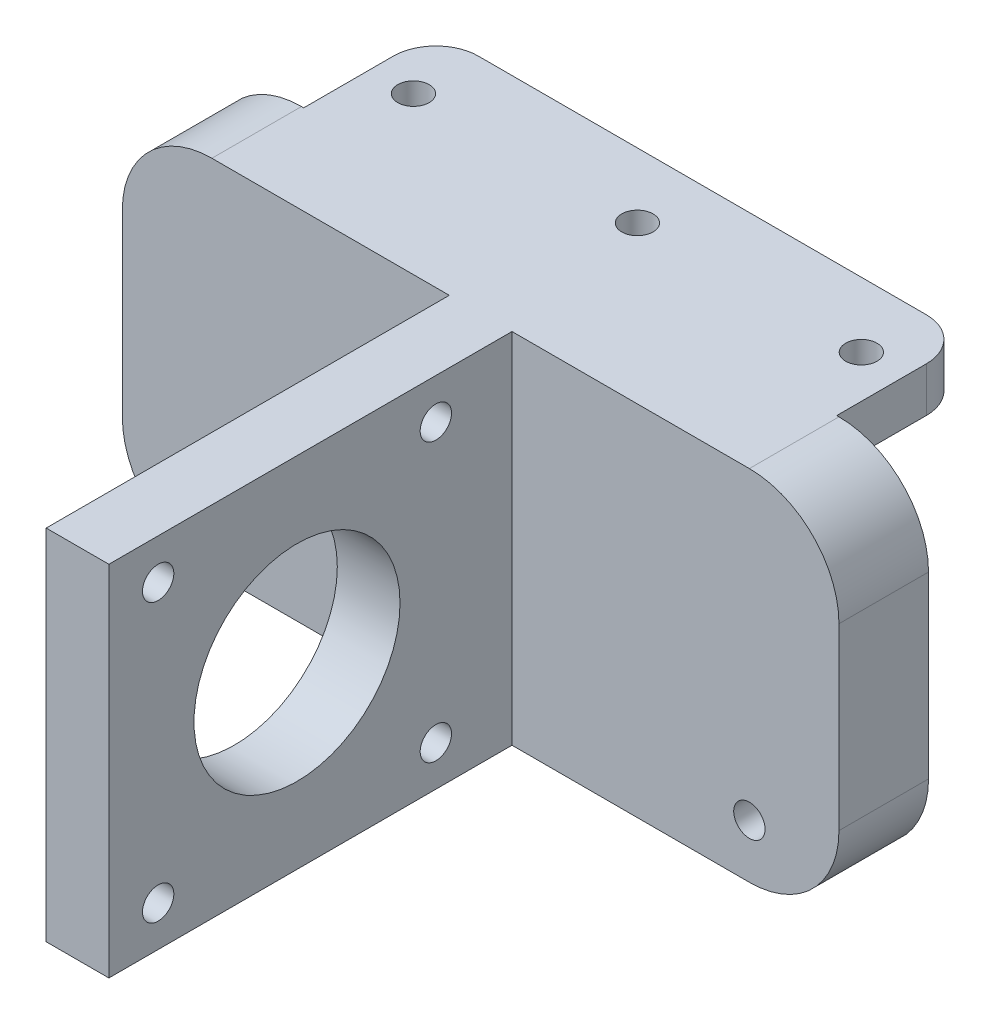
ISO-10303-21;
HEADER;
FILE_DESCRIPTION(('STEP AP214'),'2;1');
FILE_NAME('part.step','',(''),(''),'','','');
FILE_SCHEMA(('AUTOMOTIVE_DESIGN { 1 0 10303 214 1 1 1 1 }'));
ENDSEC;
DATA;
#1=APPLICATION_CONTEXT('core data for automotive mechanical design processes');
#2=APPLICATION_PROTOCOL_DEFINITION('international standard','automotive_design',2000,#1);
#3=PRODUCT_CONTEXT('',#1,'mechanical');
#4=PRODUCT('Part','Part','',(#3));
#5=PRODUCT_RELATED_PRODUCT_CATEGORY('part','',(#4));
#6=PRODUCT_DEFINITION_FORMATION('','',#4);
#7=PRODUCT_DEFINITION_CONTEXT('part definition',#1,'design');
#8=PRODUCT_DEFINITION('design','',#6,#7);
#9=PRODUCT_DEFINITION_SHAPE('','',#8);
#10=(LENGTH_UNIT() NAMED_UNIT(*) SI_UNIT(.MILLI.,.METRE.));
#11=(NAMED_UNIT(*) PLANE_ANGLE_UNIT() SI_UNIT($,.RADIAN.));
#12=(NAMED_UNIT(*) SI_UNIT($,.STERADIAN.) SOLID_ANGLE_UNIT());
#13=UNCERTAINTY_MEASURE_WITH_UNIT(LENGTH_MEASURE(1.E-05),#10,'distance_accuracy_value','');
#14=(GEOMETRIC_REPRESENTATION_CONTEXT(3) GLOBAL_UNCERTAINTY_ASSIGNED_CONTEXT((#13)) GLOBAL_UNIT_ASSIGNED_CONTEXT((#10,
#11,#12)) REPRESENTATION_CONTEXT('',''));
#15=CARTESIAN_POINT('',(0.,0.,0.));
#16=DIRECTION('',(0.,0.,1.));
#17=DIRECTION('',(1.,0.,0.));
#18=AXIS2_PLACEMENT_3D('',#15,#16,#17);
#19=CARTESIAN_POINT('',(0.,30.,10.));
#20=DIRECTION('',(0.,0.,1.));
#21=DIRECTION('',(1.,0.,0.));
#22=AXIS2_PLACEMENT_3D('',#19,#20,#21);
#23=PLANE('',#22);
#24=DIRECTION('',(0.,1.,0.));
#25=VECTOR('',#24,1.);
#26=CARTESIAN_POINT('',(33.5,40.,10.));
#27=LINE('',#26,#25);
#28=CARTESIAN_POINT('',(33.5,0.,10.));
#29=VERTEX_POINT('',#28);
#30=CARTESIAN_POINT('',(33.5,40.,10.));
#31=VERTEX_POINT('',#30);
#32=EDGE_CURVE('E50',#29,#31,#27,.T.);
#33=ORIENTED_EDGE('',*,*,#32,.F.);
#34=DIRECTION('',(1.,0.,0.));
#35=VECTOR('',#34,1.);
#36=CARTESIAN_POINT('',(0.,0.,10.));
#37=LINE('',#36,#35);
#38=CARTESIAN_POINT('',(60.,0.,10.));
#39=VERTEX_POINT('',#38);
#40=EDGE_CURVE('E245',#29,#39,#37,.T.);
#41=ORIENTED_EDGE('',*,*,#40,.T.);
#42=CARTESIAN_POINT('',(60.,10.,10.));
#43=DIRECTION('',(0.,0.,1.));
#44=DIRECTION('',(1.,0.,0.));
#45=AXIS2_PLACEMENT_3D('',#42,#43,#44);
#46=CIRCLE('',#45,10.);
#47=CARTESIAN_POINT('',(70.,10.,10.));
#48=VERTEX_POINT('',#47);
#49=EDGE_CURVE('E248',#39,#48,#46,.T.);
#50=ORIENTED_EDGE('',*,*,#49,.T.);
#51=DIRECTION('',(0.,1.,0.));
#52=VECTOR('',#51,1.);
#53=CARTESIAN_POINT('',(70.,10.,10.));
#54=LINE('',#53,#52);
#55=CARTESIAN_POINT('',(70.,30.,10.));
#56=VERTEX_POINT('',#55);
#57=EDGE_CURVE('E250',#48,#56,#54,.T.);
#58=ORIENTED_EDGE('',*,*,#57,.T.);
#59=CARTESIAN_POINT('',(60.,30.,10.));
#60=DIRECTION('',(0.,0.,1.));
#61=DIRECTION('',(1.,0.,0.));
#62=AXIS2_PLACEMENT_3D('',#59,#60,#61);
#63=CIRCLE('',#62,10.);
#64=CARTESIAN_POINT('',(60.,40.,10.));
#65=VERTEX_POINT('',#64);
#66=EDGE_CURVE('E252',#56,#65,#63,.T.);
#67=ORIENTED_EDGE('',*,*,#66,.T.);
#68=DIRECTION('',(-1.,0.,0.));
#69=VECTOR('',#68,1.);
#70=CARTESIAN_POINT('',(0.,40.,10.));
#71=LINE('',#70,#69);
#72=EDGE_CURVE('E234',#65,#31,#71,.T.);
#73=ORIENTED_EDGE('',*,*,#72,.T.);
#74=EDGE_LOOP('',(#33,#41,#50,#58,#67,#73));
#75=FACE_BOUND('',#74,.T.);
#76=CARTESIAN_POINT('',(60.,6.,10.));
#77=DIRECTION('',(0.,0.,1.));
#78=DIRECTION('',(1.,0.,0.));
#79=AXIS2_PLACEMENT_3D('',#76,#77,#78);
#80=CIRCLE('',#79,1.75);
#81=CARTESIAN_POINT('',(61.75,6.,10.));
#82=VERTEX_POINT('',#81);
#83=EDGE_CURVE('E226',#82,#82,#80,.T.);
#84=ORIENTED_EDGE('',*,*,#83,.F.);
#85=EDGE_LOOP('',(#84));
#86=FACE_BOUND('',#85,.T.);
#87=ADVANCED_FACE('F33',(#75,#86),#23,.T.);
#88=CARTESIAN_POINT('',(0.,30.,10.));
#89=DIRECTION('',(0.,0.,-1.));
#90=DIRECTION('',(-1.,0.,0.));
#91=AXIS2_PLACEMENT_3D('',#88,#89,#90);
#92=CYLINDRICAL_SURFACE('',#91,10.);
#93=CARTESIAN_POINT('',(0.,30.,0.));
#94=DIRECTION('',(0.,0.,1.));
#95=DIRECTION('',(1.,0.,0.));
#96=AXIS2_PLACEMENT_3D('',#93,#94,#95);
#97=CIRCLE('',#96,10.);
#98=CARTESIAN_POINT('',(0.,40.,0.));
#99=VERTEX_POINT('',#98);
#100=CARTESIAN_POINT('',(-10.,30.,0.));
#101=VERTEX_POINT('',#100);
#102=EDGE_CURVE('E257',#99,#101,#97,.T.);
#103=ORIENTED_EDGE('',*,*,#102,.T.);
#104=DIRECTION('',(0.,0.,-1.));
#105=VECTOR('',#104,1.);
#106=CARTESIAN_POINT('',(-10.,30.,10.));
#107=LINE('',#106,#105);
#108=CARTESIAN_POINT('',(-10.,30.,10.));
#109=VERTEX_POINT('',#108);
#110=EDGE_CURVE('E288',#109,#101,#107,.T.);
#111=ORIENTED_EDGE('',*,*,#110,.F.);
#112=CARTESIAN_POINT('',(0.,30.,10.));
#113=DIRECTION('',(0.,0.,1.));
#114=DIRECTION('',(1.,0.,0.));
#115=AXIS2_PLACEMENT_3D('',#112,#113,#114);
#116=CIRCLE('',#115,10.);
#117=CARTESIAN_POINT('',(0.,40.,10.));
#118=VERTEX_POINT('',#117);
#119=EDGE_CURVE('E238',#118,#109,#116,.T.);
#120=ORIENTED_EDGE('',*,*,#119,.F.);
#121=DIRECTION('',(0.,0.,-1.));
#122=VECTOR('',#121,1.);
#123=CARTESIAN_POINT('',(0.,40.,10.));
#124=LINE('',#123,#122);
#125=EDGE_CURVE('E291',#118,#99,#124,.T.);
#126=ORIENTED_EDGE('',*,*,#125,.T.);
#127=EDGE_LOOP('',(#103,#111,#120,#126));
#128=FACE_BOUND('',#127,.T.);
#129=ADVANCED_FACE('F35',(#128),#92,.T.);
#130=CARTESIAN_POINT('',(-10.,30.,10.));
#131=DIRECTION('',(1.,0.,0.));
#132=DIRECTION('',(0.,0.,-1.));
#133=AXIS2_PLACEMENT_3D('',#130,#131,#132);
#134=PLANE('',#133);
#135=DIRECTION('',(0.,-1.,0.));
#136=VECTOR('',#135,1.);
#137=CARTESIAN_POINT('',(-10.,30.,0.));
#138=LINE('',#137,#136);
#139=CARTESIAN_POINT('',(-10.,10.,0.));
#140=VERTEX_POINT('',#139);
#141=EDGE_CURVE('E259',#101,#140,#138,.T.);
#142=ORIENTED_EDGE('',*,*,#141,.T.);
#143=DIRECTION('',(0.,0.,-1.));
#144=VECTOR('',#143,1.);
#145=CARTESIAN_POINT('',(-10.,10.,10.));
#146=LINE('',#145,#144);
#147=CARTESIAN_POINT('',(-10.,10.,10.));
#148=VERTEX_POINT('',#147);
#149=EDGE_CURVE('E285',#148,#140,#146,.T.);
#150=ORIENTED_EDGE('',*,*,#149,.F.);
#151=DIRECTION('',(0.,-1.,0.));
#152=VECTOR('',#151,1.);
#153=CARTESIAN_POINT('',(-10.,30.,10.));
#154=LINE('',#153,#152);
#155=EDGE_CURVE('E240',#109,#148,#154,.T.);
#156=ORIENTED_EDGE('',*,*,#155,.F.);
#157=ORIENTED_EDGE('',*,*,#110,.T.);
#158=EDGE_LOOP('',(#142,#150,#156,#157));
#159=FACE_BOUND('',#158,.T.);
#160=ADVANCED_FACE('F372',(#159),#134,.F.);
#161=CARTESIAN_POINT('',(0.,10.,10.));
#162=DIRECTION('',(0.,0.,-1.));
#163=DIRECTION('',(-1.,0.,0.));
#164=AXIS2_PLACEMENT_3D('',#161,#162,#163);
#165=CYLINDRICAL_SURFACE('',#164,10.);
#166=CARTESIAN_POINT('',(0.,10.,0.));
#167=DIRECTION('',(0.,0.,1.));
#168=DIRECTION('',(1.,0.,0.));
#169=AXIS2_PLACEMENT_3D('',#166,#167,#168);
#170=CIRCLE('',#169,10.);
#171=CARTESIAN_POINT('',(0.,0.,0.));
#172=VERTEX_POINT('',#171);
#173=EDGE_CURVE('E261',#140,#172,#170,.T.);
#174=ORIENTED_EDGE('',*,*,#173,.T.);
#175=DIRECTION('',(0.,0.,-1.));
#176=VECTOR('',#175,1.);
#177=CARTESIAN_POINT('',(0.,0.,10.));
#178=LINE('',#177,#176);
#179=CARTESIAN_POINT('',(0.,0.,10.));
#180=VERTEX_POINT('',#179);
#181=EDGE_CURVE('E282',#180,#172,#178,.T.);
#182=ORIENTED_EDGE('',*,*,#181,.F.);
#183=CARTESIAN_POINT('',(0.,10.,10.));
#184=DIRECTION('',(0.,0.,1.));
#185=DIRECTION('',(1.,0.,0.));
#186=AXIS2_PLACEMENT_3D('',#183,#184,#185);
#187=CIRCLE('',#186,10.);
#188=EDGE_CURVE('E243',#148,#180,#187,.T.);
#189=ORIENTED_EDGE('',*,*,#188,.F.);
#190=ORIENTED_EDGE('',*,*,#149,.T.);
#191=EDGE_LOOP('',(#174,#182,#189,#190));
#192=FACE_BOUND('',#191,.T.);
#193=ADVANCED_FACE('F483',(#192),#165,.T.);
#194=CARTESIAN_POINT('',(0.,0.,10.));
#195=DIRECTION('',(0.,1.,0.));
#196=DIRECTION('',(0.,0.,1.));
#197=AXIS2_PLACEMENT_3D('',#194,#195,#196);
#198=PLANE('',#197);
#199=DIRECTION('',(1.,0.,0.));
#200=VECTOR('',#199,1.);
#201=CARTESIAN_POINT('',(0.,0.,0.));
#202=LINE('',#201,#200);
#203=CARTESIAN_POINT('',(60.,0.,0.));
#204=VERTEX_POINT('',#203);
#205=EDGE_CURVE('E263',#172,#204,#202,.T.);
#206=ORIENTED_EDGE('',*,*,#205,.T.);
#207=DIRECTION('',(0.,0.,-1.));
#208=VECTOR('',#207,1.);
#209=CARTESIAN_POINT('',(60.,0.,10.));
#210=LINE('',#209,#208);
#211=EDGE_CURVE('E279',#39,#204,#210,.T.);
#212=ORIENTED_EDGE('',*,*,#211,.F.);
#213=ORIENTED_EDGE('',*,*,#40,.F.);
#214=DIRECTION('',(0.,0.,-1.));
#215=VECTOR('',#214,1.);
#216=CARTESIAN_POINT('',(33.5,0.,55.));
#217=LINE('',#216,#215);
#218=CARTESIAN_POINT('',(33.5,0.,55.));
#219=VERTEX_POINT('',#218);
#220=EDGE_CURVE('E343',#219,#29,#217,.T.);
#221=ORIENTED_EDGE('',*,*,#220,.F.);
#222=DIRECTION('',(1.,0.,0.));
#223=VECTOR('',#222,1.);
#224=CARTESIAN_POINT('',(26.5,0.,55.));
#225=LINE('',#224,#223);
#226=CARTESIAN_POINT('',(26.5,0.,55.));
#227=VERTEX_POINT('',#226);
#228=EDGE_CURVE('E176',#227,#219,#225,.T.);
#229=ORIENTED_EDGE('',*,*,#228,.F.);
#230=DIRECTION('',(0.,0.,-1.));
#231=VECTOR('',#230,1.);
#232=CARTESIAN_POINT('',(26.5,0.,55.));
#233=LINE('',#232,#231);
#234=CARTESIAN_POINT('',(26.5,0.,10.));
#235=VERTEX_POINT('',#234);
#236=EDGE_CURVE('E187',#227,#235,#233,.T.);
#237=ORIENTED_EDGE('',*,*,#236,.T.);
#238=EDGE_CURVE('E246',#180,#235,#37,.T.);
#239=ORIENTED_EDGE('',*,*,#238,.F.);
#240=ORIENTED_EDGE('',*,*,#181,.T.);
#241=EDGE_LOOP('',(#206,#212,#213,#221,#229,#237,#239,#240));
#242=FACE_BOUND('',#241,.T.);
#243=ADVANCED_FACE('F350',(#242),#198,.F.);
#244=CARTESIAN_POINT('',(60.,10.,10.));
#245=DIRECTION('',(0.,0.,-1.));
#246=DIRECTION('',(-1.,0.,0.));
#247=AXIS2_PLACEMENT_3D('',#244,#245,#246);
#248=CYLINDRICAL_SURFACE('',#247,10.);
#249=CARTESIAN_POINT('',(60.,10.,0.));
#250=DIRECTION('',(0.,0.,1.));
#251=DIRECTION('',(1.,0.,0.));
#252=AXIS2_PLACEMENT_3D('',#249,#250,#251);
#253=CIRCLE('',#252,10.);
#254=CARTESIAN_POINT('',(70.,10.,0.));
#255=VERTEX_POINT('',#254);
#256=EDGE_CURVE('E265',#204,#255,#253,.T.);
#257=ORIENTED_EDGE('',*,*,#256,.T.);
#258=DIRECTION('',(0.,0.,-1.));
#259=VECTOR('',#258,1.);
#260=CARTESIAN_POINT('',(70.,10.,10.));
#261=LINE('',#260,#259);
#262=EDGE_CURVE('E276',#48,#255,#261,.T.);
#263=ORIENTED_EDGE('',*,*,#262,.F.);
#264=ORIENTED_EDGE('',*,*,#49,.F.);
#265=ORIENTED_EDGE('',*,*,#211,.T.);
#266=EDGE_LOOP('',(#257,#263,#264,#265));
#267=FACE_BOUND('',#266,.T.);
#268=ADVANCED_FACE('F491',(#267),#248,.T.);
#269=CARTESIAN_POINT('',(70.,10.,10.));
#270=DIRECTION('',(-1.,0.,0.));
#271=DIRECTION('',(0.,0.,1.));
#272=AXIS2_PLACEMENT_3D('',#269,#270,#271);
#273=PLANE('',#272);
#274=DIRECTION('',(0.,1.,0.));
#275=VECTOR('',#274,1.);
#276=CARTESIAN_POINT('',(70.,10.,0.));
#277=LINE('',#276,#275);
#278=CARTESIAN_POINT('',(70.,30.,0.));
#279=VERTEX_POINT('',#278);
#280=EDGE_CURVE('E267',#255,#279,#277,.T.);
#281=ORIENTED_EDGE('',*,*,#280,.T.);
#282=DIRECTION('',(0.,0.,-1.));
#283=VECTOR('',#282,1.);
#284=CARTESIAN_POINT('',(70.,30.,10.));
#285=LINE('',#284,#283);
#286=EDGE_CURVE('E273',#56,#279,#285,.T.);
#287=ORIENTED_EDGE('',*,*,#286,.F.);
#288=ORIENTED_EDGE('',*,*,#57,.F.);
#289=ORIENTED_EDGE('',*,*,#262,.T.);
#290=EDGE_LOOP('',(#281,#287,#288,#289));
#291=FACE_BOUND('',#290,.T.);
#292=ADVANCED_FACE('F387',(#291),#273,.F.);
#293=CARTESIAN_POINT('',(60.,30.,10.));
#294=DIRECTION('',(0.,0.,-1.));
#295=DIRECTION('',(-1.,0.,0.));
#296=AXIS2_PLACEMENT_3D('',#293,#294,#295);
#297=CYLINDRICAL_SURFACE('',#296,10.);
#298=CARTESIAN_POINT('',(60.,30.,0.));
#299=DIRECTION('',(0.,0.,1.));
#300=DIRECTION('',(1.,0.,0.));
#301=AXIS2_PLACEMENT_3D('',#298,#299,#300);
#302=CIRCLE('',#301,10.);
#303=CARTESIAN_POINT('',(60.,40.,0.));
#304=VERTEX_POINT('',#303);
#305=EDGE_CURVE('E241',#279,#304,#302,.T.);
#306=ORIENTED_EDGE('',*,*,#305,.T.);
#307=DIRECTION('',(0.,0.,-1.));
#308=VECTOR('',#307,1.);
#309=CARTESIAN_POINT('',(60.,40.,10.));
#310=LINE('',#309,#308);
#311=EDGE_CURVE('E254',#65,#304,#310,.T.);
#312=ORIENTED_EDGE('',*,*,#311,.F.);
#313=ORIENTED_EDGE('',*,*,#66,.F.);
#314=ORIENTED_EDGE('',*,*,#286,.T.);
#315=EDGE_LOOP('',(#306,#312,#313,#314));
#316=FACE_BOUND('',#315,.T.);
#317=ADVANCED_FACE('F379',(#316),#297,.T.);
#318=DIRECTION('',(0.,-1.,0.));
#319=VECTOR('',#318,1.);
#320=CARTESIAN_POINT('',(26.5,40.,10.));
#321=LINE('',#320,#319);
#322=CARTESIAN_POINT('',(26.5,40.,10.));
#323=VERTEX_POINT('',#322);
#324=EDGE_CURVE('E58',#323,#235,#321,.T.);
#325=ORIENTED_EDGE('',*,*,#324,.F.);
#326=EDGE_CURVE('E237',#323,#118,#71,.T.);
#327=ORIENTED_EDGE('',*,*,#326,.T.);
#328=ORIENTED_EDGE('',*,*,#119,.T.);
#329=ORIENTED_EDGE('',*,*,#155,.T.);
#330=ORIENTED_EDGE('',*,*,#188,.T.);
#331=ORIENTED_EDGE('',*,*,#238,.T.);
#332=EDGE_LOOP('',(#325,#327,#328,#329,#330,#331));
#333=FACE_BOUND('',#332,.T.);
#334=CARTESIAN_POINT('',(0.,6.,10.));
#335=DIRECTION('',(0.,0.,1.));
#336=DIRECTION('',(1.,0.,0.));
#337=AXIS2_PLACEMENT_3D('',#334,#335,#336);
#338=CIRCLE('',#337,1.75);
#339=CARTESIAN_POINT('',(1.75,6.,10.));
#340=VERTEX_POINT('',#339);
#341=EDGE_CURVE('E230',#340,#340,#338,.T.);
#342=ORIENTED_EDGE('',*,*,#341,.F.);
#343=EDGE_LOOP('',(#342));
#344=FACE_BOUND('',#343,.T.);
#345=ADVANCED_FACE('F366',(#333,#344),#23,.T.);
#346=CARTESIAN_POINT('',(0.,30.,0.));
#347=DIRECTION('',(0.,0.,1.));
#348=DIRECTION('',(1.,0.,0.));
#349=AXIS2_PLACEMENT_3D('',#346,#347,#348);
#350=PLANE('',#349);
#351=ORIENTED_EDGE('',*,*,#102,.F.);
#352=DIRECTION('',(1.,0.,0.));
#353=VECTOR('',#352,1.);
#354=CARTESIAN_POINT('',(0.,40.,0.));
#355=LINE('',#354,#353);
#356=CARTESIAN_POINT('',(0.250000000000006,40.,0.));
#357=VERTEX_POINT('',#356);
#358=EDGE_CURVE('E11',#99,#357,#355,.T.);
#359=ORIENTED_EDGE('',*,*,#358,.T.);
#360=DIRECTION('',(0.,-1.,0.));
#361=VECTOR('',#360,1.);
#362=CARTESIAN_POINT('',(0.250000000000006,60.,0.));
#363=LINE('',#362,#361);
#364=CARTESIAN_POINT('',(0.250000000000006,35.,0.));
#365=VERTEX_POINT('',#364);
#366=EDGE_CURVE('E203',#357,#365,#363,.T.);
#367=ORIENTED_EDGE('',*,*,#366,.T.);
#368=DIRECTION('',(-1.,0.,0.));
#369=VECTOR('',#368,1.);
#370=CARTESIAN_POINT('',(60.,35.,0.));
#371=LINE('',#370,#369);
#372=CARTESIAN_POINT('',(59.75,35.,0.));
#373=VERTEX_POINT('',#372);
#374=EDGE_CURVE('E236',#373,#365,#371,.T.);
#375=ORIENTED_EDGE('',*,*,#374,.F.);
#376=DIRECTION('',(0.,-1.,0.));
#377=VECTOR('',#376,1.);
#378=CARTESIAN_POINT('',(59.75,60.,0.));
#379=LINE('',#378,#377);
#380=CARTESIAN_POINT('',(59.75,40.,0.));
#381=VERTEX_POINT('',#380);
#382=EDGE_CURVE('E202',#381,#373,#379,.T.);
#383=ORIENTED_EDGE('',*,*,#382,.F.);
#384=DIRECTION('',(1.,0.,0.));
#385=VECTOR('',#384,1.);
#386=CARTESIAN_POINT('',(0.,40.,0.));
#387=LINE('',#386,#385);
#388=EDGE_CURVE('E294',#381,#304,#387,.T.);
#389=ORIENTED_EDGE('',*,*,#388,.T.);
#390=ORIENTED_EDGE('',*,*,#305,.F.);
#391=ORIENTED_EDGE('',*,*,#280,.F.);
#392=ORIENTED_EDGE('',*,*,#256,.F.);
#393=ORIENTED_EDGE('',*,*,#205,.F.);
#394=ORIENTED_EDGE('',*,*,#173,.F.);
#395=ORIENTED_EDGE('',*,*,#141,.F.);
#396=EDGE_LOOP('',(#351,#359,#367,#375,#383,#389,#390,#391,#392,#393,#394,#395));
#397=FACE_BOUND('',#396,.T.);
#398=CARTESIAN_POINT('',(60.,6.,0.));
#399=DIRECTION('',(0.,0.,1.));
#400=DIRECTION('',(1.,0.,0.));
#401=AXIS2_PLACEMENT_3D('',#398,#399,#400);
#402=CIRCLE('',#401,1.75);
#403=CARTESIAN_POINT('',(61.75,6.,0.));
#404=VERTEX_POINT('',#403);
#405=EDGE_CURVE('E229',#404,#404,#402,.T.);
#406=ORIENTED_EDGE('',*,*,#405,.T.);
#407=EDGE_LOOP('',(#406));
#408=FACE_BOUND('',#407,.T.);
#409=CARTESIAN_POINT('',(0.,6.,0.));
#410=DIRECTION('',(0.,0.,1.));
#411=DIRECTION('',(1.,0.,0.));
#412=AXIS2_PLACEMENT_3D('',#409,#410,#411);
#413=CIRCLE('',#412,1.75);
#414=CARTESIAN_POINT('',(1.75,6.,0.));
#415=VERTEX_POINT('',#414);
#416=EDGE_CURVE('E233',#415,#415,#413,.T.);
#417=ORIENTED_EDGE('',*,*,#416,.T.);
#418=EDGE_LOOP('',(#417));
#419=FACE_BOUND('',#418,.T.);
#420=ADVANCED_FACE('F378',(#397,#408,#419),#350,.F.);
#421=CARTESIAN_POINT('',(0.,35.,-15.));
#422=DIRECTION('',(0.,-1.,0.));
#423=DIRECTION('',(0.,0.,-1.));
#424=AXIS2_PLACEMENT_3D('',#421,#422,#423);
#425=PLANE('',#424);
#426=DIRECTION('',(0.,0.,1.));
#427=VECTOR('',#426,1.);
#428=CARTESIAN_POINT('',(0.250000000000005,35.,-0.25));
#429=LINE('',#428,#427);
#430=CARTESIAN_POINT('',(0.250000000000006,35.,-10.));
#431=VERTEX_POINT('',#430);
#432=EDGE_CURVE('E199',#431,#365,#429,.T.);
#433=ORIENTED_EDGE('',*,*,#432,.F.);
#434=CARTESIAN_POINT('',(5.00000000000001,35.,-10.));
#435=DIRECTION('',(0.,1.,0.));
#436=DIRECTION('',(0.,0.,-1.));
#437=AXIS2_PLACEMENT_3D('',#434,#435,#436);
#438=CIRCLE('',#437,4.75);
#439=CARTESIAN_POINT('',(5.,35.,-14.75));
#440=VERTEX_POINT('',#439);
#441=EDGE_CURVE('E196',#440,#431,#438,.T.);
#442=ORIENTED_EDGE('',*,*,#441,.F.);
#443=DIRECTION('',(-1.,0.,0.));
#444=VECTOR('',#443,1.);
#445=CARTESIAN_POINT('',(5.,35.,-14.75));
#446=LINE('',#445,#444);
#447=CARTESIAN_POINT('',(55.,35.,-14.75));
#448=VERTEX_POINT('',#447);
#449=EDGE_CURVE('E193',#448,#440,#446,.T.);
#450=ORIENTED_EDGE('',*,*,#449,.F.);
#451=CARTESIAN_POINT('',(55.,35.,-10.));
#452=DIRECTION('',(0.,1.,0.));
#453=DIRECTION('',(0.,0.,-1.));
#454=AXIS2_PLACEMENT_3D('',#451,#452,#453);
#455=CIRCLE('',#454,4.75);
#456=CARTESIAN_POINT('',(59.75,35.,-10.));
#457=VERTEX_POINT('',#456);
#458=EDGE_CURVE('E185',#457,#448,#455,.T.);
#459=ORIENTED_EDGE('',*,*,#458,.F.);
#460=DIRECTION('',(0.,0.,-1.));
#461=VECTOR('',#460,1.);
#462=CARTESIAN_POINT('',(59.75,35.,-10.));
#463=LINE('',#462,#461);
#464=EDGE_CURVE('E182',#373,#457,#463,.T.);
#465=ORIENTED_EDGE('',*,*,#464,.F.);
#466=ORIENTED_EDGE('',*,*,#374,.T.);
#467=EDGE_LOOP('',(#433,#442,#450,#459,#465,#466));
#468=FACE_BOUND('',#467,.T.);
#469=CARTESIAN_POINT('',(30.,35.,-7.5));
#470=DIRECTION('',(0.,-1.,0.));
#471=DIRECTION('',(0.,0.,-1.));
#472=AXIS2_PLACEMENT_3D('',#469,#470,#471);
#473=CIRCLE('',#472,1.75);
#474=CARTESIAN_POINT('',(30.,35.,-9.25));
#475=VERTEX_POINT('',#474);
#476=EDGE_CURVE('E215',#475,#475,#473,.T.);
#477=ORIENTED_EDGE('',*,*,#476,.F.);
#478=EDGE_LOOP('',(#477));
#479=FACE_BOUND('',#478,.T.);
#480=CARTESIAN_POINT('',(5.00000000000001,35.,-7.5));
#481=DIRECTION('',(0.,-1.,0.));
#482=DIRECTION('',(0.,0.,-1.));
#483=AXIS2_PLACEMENT_3D('',#480,#481,#482);
#484=CIRCLE('',#483,1.75);
#485=CARTESIAN_POINT('',(5.00000000000001,35.,-9.25));
#486=VERTEX_POINT('',#485);
#487=EDGE_CURVE('E205',#486,#486,#484,.T.);
#488=ORIENTED_EDGE('',*,*,#487,.F.);
#489=EDGE_LOOP('',(#488));
#490=FACE_BOUND('',#489,.T.);
#491=CARTESIAN_POINT('',(55.,35.,-7.5));
#492=DIRECTION('',(0.,-1.,0.));
#493=DIRECTION('',(0.,0.,-1.));
#494=AXIS2_PLACEMENT_3D('',#491,#492,#493);
#495=CIRCLE('',#494,1.75);
#496=CARTESIAN_POINT('',(55.,35.,-9.25000000000001));
#497=VERTEX_POINT('',#496);
#498=EDGE_CURVE('E221',#497,#497,#495,.T.);
#499=ORIENTED_EDGE('',*,*,#498,.F.);
#500=EDGE_LOOP('',(#499));
#501=FACE_BOUND('',#500,.T.);
#502=ADVANCED_FACE('F384',(#468,#479,#490,#501),#425,.T.);
#503=CARTESIAN_POINT('',(0.,40.,-15.));
#504=DIRECTION('',(0.,1.,0.));
#505=DIRECTION('',(0.,0.,1.));
#506=AXIS2_PLACEMENT_3D('',#503,#504,#505);
#507=PLANE('',#506);
#508=ORIENTED_EDGE('',*,*,#358,.F.);
#509=ORIENTED_EDGE('',*,*,#125,.F.);
#510=ORIENTED_EDGE('',*,*,#326,.F.);
#511=DIRECTION('',(0.,0.,-1.));
#512=VECTOR('',#511,1.);
#513=CARTESIAN_POINT('',(26.5,40.,55.));
#514=LINE('',#513,#512);
#515=CARTESIAN_POINT('',(26.5,40.,55.));
#516=VERTEX_POINT('',#515);
#517=EDGE_CURVE('E167',#516,#323,#514,.T.);
#518=ORIENTED_EDGE('',*,*,#517,.F.);
#519=DIRECTION('',(-1.,0.,0.));
#520=VECTOR('',#519,1.);
#521=CARTESIAN_POINT('',(26.5,40.,55.));
#522=LINE('',#521,#520);
#523=CARTESIAN_POINT('',(33.5,40.,55.));
#524=VERTEX_POINT('',#523);
#525=EDGE_CURVE('E159',#524,#516,#522,.T.);
#526=ORIENTED_EDGE('',*,*,#525,.F.);
#527=DIRECTION('',(0.,0.,-1.));
#528=VECTOR('',#527,1.);
#529=CARTESIAN_POINT('',(33.5,40.,55.));
#530=LINE('',#529,#528);
#531=EDGE_CURVE('E165',#524,#31,#530,.T.);
#532=ORIENTED_EDGE('',*,*,#531,.T.);
#533=ORIENTED_EDGE('',*,*,#72,.F.);
#534=ORIENTED_EDGE('',*,*,#311,.T.);
#535=ORIENTED_EDGE('',*,*,#388,.F.);
#536=DIRECTION('',(0.,0.,1.));
#537=VECTOR('',#536,1.);
#538=CARTESIAN_POINT('',(59.75,40.,-15.));
#539=LINE('',#538,#537);
#540=CARTESIAN_POINT('',(59.75,40.,-10.));
#541=VERTEX_POINT('',#540);
#542=EDGE_CURVE('E306',#541,#381,#539,.T.);
#543=ORIENTED_EDGE('',*,*,#542,.F.);
#544=CARTESIAN_POINT('',(55.,40.,-10.));
#545=DIRECTION('',(0.,1.,0.));
#546=DIRECTION('',(0.,0.,1.));
#547=AXIS2_PLACEMENT_3D('',#544,#545,#546);
#548=CIRCLE('',#547,4.75);
#549=CARTESIAN_POINT('',(55.,40.,-14.75));
#550=VERTEX_POINT('',#549);
#551=EDGE_CURVE('E309',#550,#541,#548,.F.);
#552=ORIENTED_EDGE('',*,*,#551,.F.);
#553=DIRECTION('',(1.,0.,0.));
#554=VECTOR('',#553,1.);
#555=CARTESIAN_POINT('',(0.,40.,-14.75));
#556=LINE('',#555,#554);
#557=CARTESIAN_POINT('',(5.,40.,-14.75));
#558=VERTEX_POINT('',#557);
#559=EDGE_CURVE('E311',#558,#550,#556,.T.);
#560=ORIENTED_EDGE('',*,*,#559,.F.);
#561=CARTESIAN_POINT('',(5.00000000000001,40.,-10.));
#562=DIRECTION('',(0.,1.,0.));
#563=DIRECTION('',(0.,0.,1.));
#564=AXIS2_PLACEMENT_3D('',#561,#562,#563);
#565=CIRCLE('',#564,4.75);
#566=CARTESIAN_POINT('',(0.250000000000006,40.,-10.));
#567=VERTEX_POINT('',#566);
#568=EDGE_CURVE('E313',#567,#558,#565,.F.);
#569=ORIENTED_EDGE('',*,*,#568,.F.);
#570=DIRECTION('',(0.,0.,-1.));
#571=VECTOR('',#570,1.);
#572=CARTESIAN_POINT('',(0.249999999999948,40.,-15.));
#573=LINE('',#572,#571);
#574=EDGE_CURVE('E42',#357,#567,#573,.T.);
#575=ORIENTED_EDGE('',*,*,#574,.F.);
#576=EDGE_LOOP('',(#508,#509,#510,#518,#526,#532,#533,#534,#535,#543,#552,#560,#569,#575));
#577=FACE_BOUND('',#576,.T.);
#578=CARTESIAN_POINT('',(30.,40.,-7.5));
#579=DIRECTION('',(0.,1.,0.));
#580=DIRECTION('',(0.,0.,1.));
#581=AXIS2_PLACEMENT_3D('',#578,#579,#580);
#582=CIRCLE('',#581,1.75);
#583=CARTESIAN_POINT('',(30.,40.,-5.75));
#584=VERTEX_POINT('',#583);
#585=EDGE_CURVE('E225',#584,#584,#582,.T.);
#586=ORIENTED_EDGE('',*,*,#585,.F.);
#587=EDGE_LOOP('',(#586));
#588=FACE_BOUND('',#587,.T.);
#589=CARTESIAN_POINT('',(5.00000000000001,40.,-7.5));
#590=DIRECTION('',(0.,1.,0.));
#591=DIRECTION('',(0.,0.,1.));
#592=AXIS2_PLACEMENT_3D('',#589,#590,#591);
#593=CIRCLE('',#592,1.75);
#594=CARTESIAN_POINT('',(5.00000000000001,40.,-5.75));
#595=VERTEX_POINT('',#594);
#596=EDGE_CURVE('E218',#595,#595,#593,.T.);
#597=ORIENTED_EDGE('',*,*,#596,.F.);
#598=EDGE_LOOP('',(#597));
#599=FACE_BOUND('',#598,.T.);
#600=CARTESIAN_POINT('',(55.,40.,-7.5));
#601=DIRECTION('',(0.,1.,0.));
#602=DIRECTION('',(0.,0.,1.));
#603=AXIS2_PLACEMENT_3D('',#600,#601,#602);
#604=CIRCLE('',#603,1.75);
#605=CARTESIAN_POINT('',(55.,40.,-5.75));
#606=VERTEX_POINT('',#605);
#607=EDGE_CURVE('E224',#606,#606,#604,.T.);
#608=ORIENTED_EDGE('',*,*,#607,.F.);
#609=EDGE_LOOP('',(#608));
#610=FACE_BOUND('',#609,.T.);
#611=ADVANCED_FACE('F161',(#577,#588,#599,#610),#507,.T.);
#612=CARTESIAN_POINT('',(0.,6.,-15.));
#613=DIRECTION('',(0.,0.,1.));
#614=DIRECTION('',(1.,0.,0.));
#615=AXIS2_PLACEMENT_3D('',#612,#613,#614);
#616=CYLINDRICAL_SURFACE('',#615,1.75);
#617=ORIENTED_EDGE('',*,*,#341,.T.);
#618=EDGE_LOOP('',(#617));
#619=FACE_BOUND('',#618,.T.);
#620=ORIENTED_EDGE('',*,*,#416,.F.);
#621=EDGE_LOOP('',(#620));
#622=FACE_BOUND('',#621,.T.);
#623=ADVANCED_FACE('F393',(#619,#622),#616,.F.);
#624=CARTESIAN_POINT('',(60.,6.,-15.));
#625=DIRECTION('',(0.,0.,1.));
#626=DIRECTION('',(1.,0.,0.));
#627=AXIS2_PLACEMENT_3D('',#624,#625,#626);
#628=CYLINDRICAL_SURFACE('',#627,1.75);
#629=ORIENTED_EDGE('',*,*,#83,.T.);
#630=EDGE_LOOP('',(#629));
#631=FACE_BOUND('',#630,.T.);
#632=ORIENTED_EDGE('',*,*,#405,.F.);
#633=EDGE_LOOP('',(#632));
#634=FACE_BOUND('',#633,.T.);
#635=ADVANCED_FACE('F396',(#631,#634),#628,.F.);
#636=CARTESIAN_POINT('',(55.,60.,-7.5));
#637=DIRECTION('',(0.,-1.,0.));
#638=DIRECTION('',(0.,0.,-1.));
#639=AXIS2_PLACEMENT_3D('',#636,#637,#638);
#640=CYLINDRICAL_SURFACE('',#639,1.75);
#641=ORIENTED_EDGE('',*,*,#607,.T.);
#642=EDGE_LOOP('',(#641));
#643=FACE_BOUND('',#642,.T.);
#644=ORIENTED_EDGE('',*,*,#498,.T.);
#645=EDGE_LOOP('',(#644));
#646=FACE_BOUND('',#645,.T.);
#647=ADVANCED_FACE('F404',(#643,#646),#640,.F.);
#648=CARTESIAN_POINT('',(5.00000000000001,60.,-7.5));
#649=DIRECTION('',(0.,-1.,0.));
#650=DIRECTION('',(0.,0.,-1.));
#651=AXIS2_PLACEMENT_3D('',#648,#649,#650);
#652=CYLINDRICAL_SURFACE('',#651,1.75);
#653=ORIENTED_EDGE('',*,*,#596,.T.);
#654=EDGE_LOOP('',(#653));
#655=FACE_BOUND('',#654,.T.);
#656=ORIENTED_EDGE('',*,*,#487,.T.);
#657=EDGE_LOOP('',(#656));
#658=FACE_BOUND('',#657,.T.);
#659=ADVANCED_FACE('F425',(#655,#658),#652,.F.);
#660=CARTESIAN_POINT('',(30.,60.,-7.5));
#661=DIRECTION('',(0.,-1.,0.));
#662=DIRECTION('',(0.,0.,-1.));
#663=AXIS2_PLACEMENT_3D('',#660,#661,#662);
#664=CYLINDRICAL_SURFACE('',#663,1.75);
#665=ORIENTED_EDGE('',*,*,#585,.T.);
#666=EDGE_LOOP('',(#665));
#667=FACE_BOUND('',#666,.T.);
#668=ORIENTED_EDGE('',*,*,#476,.T.);
#669=EDGE_LOOP('',(#668));
#670=FACE_BOUND('',#669,.T.);
#671=ADVANCED_FACE('F430',(#667,#670),#664,.F.);
#672=CARTESIAN_POINT('',(0.250000000000005,60.,-0.25));
#673=DIRECTION('',(1.,0.,0.));
#674=DIRECTION('',(0.,0.,-1.));
#675=AXIS2_PLACEMENT_3D('',#672,#673,#674);
#676=PLANE('',#675);
#677=ORIENTED_EDGE('',*,*,#574,.T.);
#678=DIRECTION('',(0.,-1.,0.));
#679=VECTOR('',#678,1.);
#680=CARTESIAN_POINT('',(0.250000000000006,60.,-10.));
#681=LINE('',#680,#679);
#682=EDGE_CURVE('E206',#567,#431,#681,.T.);
#683=ORIENTED_EDGE('',*,*,#682,.T.);
#684=ORIENTED_EDGE('',*,*,#432,.T.);
#685=ORIENTED_EDGE('',*,*,#366,.F.);
#686=EDGE_LOOP('',(#677,#683,#684,#685));
#687=FACE_BOUND('',#686,.T.);
#688=ADVANCED_FACE('F436',(#687),#676,.F.);
#689=CARTESIAN_POINT('',(5.00000000000001,60.,-10.));
#690=DIRECTION('',(0.,-1.,0.));
#691=DIRECTION('',(0.,0.,-1.));
#692=AXIS2_PLACEMENT_3D('',#689,#690,#691);
#693=CYLINDRICAL_SURFACE('',#692,4.75);
#694=ORIENTED_EDGE('',*,*,#568,.T.);
#695=DIRECTION('',(0.,-1.,0.));
#696=VECTOR('',#695,1.);
#697=CARTESIAN_POINT('',(5.,60.,-14.75));
#698=LINE('',#697,#696);
#699=EDGE_CURVE('E208',#558,#440,#698,.T.);
#700=ORIENTED_EDGE('',*,*,#699,.T.);
#701=ORIENTED_EDGE('',*,*,#441,.T.);
#702=ORIENTED_EDGE('',*,*,#682,.F.);
#703=EDGE_LOOP('',(#694,#700,#701,#702));
#704=FACE_BOUND('',#703,.T.);
#705=ADVANCED_FACE('F448',(#704),#693,.T.);
#706=CARTESIAN_POINT('',(5.,60.,-14.75));
#707=DIRECTION('',(0.,0.,1.));
#708=DIRECTION('',(1.,0.,0.));
#709=AXIS2_PLACEMENT_3D('',#706,#707,#708);
#710=PLANE('',#709);
#711=ORIENTED_EDGE('',*,*,#559,.T.);
#712=DIRECTION('',(0.,-1.,0.));
#713=VECTOR('',#712,1.);
#714=CARTESIAN_POINT('',(55.,60.,-14.75));
#715=LINE('',#714,#713);
#716=EDGE_CURVE('E210',#550,#448,#715,.T.);
#717=ORIENTED_EDGE('',*,*,#716,.T.);
#718=ORIENTED_EDGE('',*,*,#449,.T.);
#719=ORIENTED_EDGE('',*,*,#699,.F.);
#720=EDGE_LOOP('',(#711,#717,#718,#719));
#721=FACE_BOUND('',#720,.T.);
#722=ADVANCED_FACE('F444',(#721),#710,.F.);
#723=CARTESIAN_POINT('',(55.,60.,-10.));
#724=DIRECTION('',(0.,-1.,0.));
#725=DIRECTION('',(0.,0.,-1.));
#726=AXIS2_PLACEMENT_3D('',#723,#724,#725);
#727=CYLINDRICAL_SURFACE('',#726,4.75);
#728=ORIENTED_EDGE('',*,*,#551,.T.);
#729=DIRECTION('',(0.,-1.,0.));
#730=VECTOR('',#729,1.);
#731=CARTESIAN_POINT('',(59.75,60.,-10.));
#732=LINE('',#731,#730);
#733=EDGE_CURVE('E212',#541,#457,#732,.T.);
#734=ORIENTED_EDGE('',*,*,#733,.T.);
#735=ORIENTED_EDGE('',*,*,#458,.T.);
#736=ORIENTED_EDGE('',*,*,#716,.F.);
#737=EDGE_LOOP('',(#728,#734,#735,#736));
#738=FACE_BOUND('',#737,.T.);
#739=ADVANCED_FACE('F440',(#738),#727,.T.);
#740=CARTESIAN_POINT('',(59.75,60.,-10.));
#741=DIRECTION('',(-1.,0.,0.));
#742=DIRECTION('',(0.,0.,1.));
#743=AXIS2_PLACEMENT_3D('',#740,#741,#742);
#744=PLANE('',#743);
#745=ORIENTED_EDGE('',*,*,#542,.T.);
#746=ORIENTED_EDGE('',*,*,#382,.T.);
#747=ORIENTED_EDGE('',*,*,#464,.T.);
#748=ORIENTED_EDGE('',*,*,#733,.F.);
#749=EDGE_LOOP('',(#745,#746,#747,#748));
#750=FACE_BOUND('',#749,.T.);
#751=ADVANCED_FACE('F361',(#750),#744,.F.);
#752=CARTESIAN_POINT('',(33.5,40.,55.));
#753=DIRECTION('',(-1.,0.,0.));
#754=DIRECTION('',(0.,0.,1.));
#755=AXIS2_PLACEMENT_3D('',#752,#753,#754);
#756=PLANE('',#755);
#757=CARTESIAN_POINT('',(33.5,35.5,49.5));
#758=DIRECTION('',(1.,0.,0.));
#759=DIRECTION('',(0.,0.,-1.));
#760=AXIS2_PLACEMENT_3D('',#757,#758,#759);
#761=CIRCLE('',#760,1.75);
#762=CARTESIAN_POINT('',(33.5,35.5,47.75));
#763=VERTEX_POINT('',#762);
#764=EDGE_CURVE('E324',#763,#763,#761,.T.);
#765=ORIENTED_EDGE('',*,*,#764,.F.);
#766=EDGE_LOOP('',(#765));
#767=FACE_BOUND('',#766,.T.);
#768=CARTESIAN_POINT('',(33.5,35.5000000000004,18.5));
#769=DIRECTION('',(1.,0.,0.));
#770=DIRECTION('',(0.,0.,-1.));
#771=AXIS2_PLACEMENT_3D('',#768,#769,#770);
#772=CIRCLE('',#771,1.75);
#773=CARTESIAN_POINT('',(33.5,35.5000000000004,16.75));
#774=VERTEX_POINT('',#773);
#775=EDGE_CURVE('E688',#774,#774,#772,.T.);
#776=ORIENTED_EDGE('',*,*,#775,.F.);
#777=EDGE_LOOP('',(#776));
#778=FACE_BOUND('',#777,.T.);
#779=CARTESIAN_POINT('',(33.5,4.50000000000032,18.4999999999997));
#780=DIRECTION('',(1.,0.,0.));
#781=DIRECTION('',(0.,0.,-1.));
#782=AXIS2_PLACEMENT_3D('',#779,#780,#781);
#783=CIRCLE('',#782,1.75);
#784=CARTESIAN_POINT('',(33.5,4.50000000000032,16.7499999999997));
#785=VERTEX_POINT('',#784);
#786=EDGE_CURVE('E691',#785,#785,#783,.T.);
#787=ORIENTED_EDGE('',*,*,#786,.F.);
#788=EDGE_LOOP('',(#787));
#789=FACE_BOUND('',#788,.T.);
#790=CARTESIAN_POINT('',(33.5,4.50000000000016,49.4999999999997));
#791=DIRECTION('',(1.,0.,0.));
#792=DIRECTION('',(0.,0.,-1.));
#793=AXIS2_PLACEMENT_3D('',#790,#791,#792);
#794=CIRCLE('',#793,1.75);
#795=CARTESIAN_POINT('',(33.5,4.50000000000016,47.7499999999997));
#796=VERTEX_POINT('',#795);
#797=EDGE_CURVE('E338',#796,#796,#794,.T.);
#798=ORIENTED_EDGE('',*,*,#797,.F.);
#799=EDGE_LOOP('',(#798));
#800=FACE_BOUND('',#799,.T.);
#801=CARTESIAN_POINT('',(33.5,20.,34.));
#802=DIRECTION('',(1.,0.,0.));
#803=DIRECTION('',(0.,0.,-1.));
#804=AXIS2_PLACEMENT_3D('',#801,#802,#803);
#805=CIRCLE('',#804,11.5);
#806=CARTESIAN_POINT('',(33.5,20.,22.5));
#807=VERTEX_POINT('',#806);
#808=EDGE_CURVE('E319',#807,#807,#805,.T.);
#809=ORIENTED_EDGE('',*,*,#808,.F.);
#810=EDGE_LOOP('',(#809));
#811=FACE_BOUND('',#810,.T.);
#812=ORIENTED_EDGE('',*,*,#32,.T.);
#813=ORIENTED_EDGE('',*,*,#531,.F.);
#814=DIRECTION('',(0.,1.,0.));
#815=VECTOR('',#814,1.);
#816=CARTESIAN_POINT('',(33.5,40.,55.));
#817=LINE('',#816,#815);
#818=EDGE_CURVE('E171',#219,#524,#817,.T.);
#819=ORIENTED_EDGE('',*,*,#818,.F.);
#820=ORIENTED_EDGE('',*,*,#220,.T.);
#821=EDGE_LOOP('',(#812,#813,#819,#820));
#822=FACE_BOUND('',#821,.T.);
#823=ADVANCED_FACE('F181',(#767,#778,#789,#800,#811,#822),#756,.F.);
#824=CARTESIAN_POINT('',(26.5,40.,55.));
#825=DIRECTION('',(1.,0.,0.));
#826=DIRECTION('',(0.,0.,-1.));
#827=AXIS2_PLACEMENT_3D('',#824,#825,#826);
#828=PLANE('',#827);
#829=CARTESIAN_POINT('',(26.5,35.5,49.5));
#830=DIRECTION('',(1.,0.,0.));
#831=DIRECTION('',(0.,0.,-1.));
#832=AXIS2_PLACEMENT_3D('',#829,#830,#831);
#833=CIRCLE('',#832,1.75);
#834=CARTESIAN_POINT('',(26.5,35.5,47.75));
#835=VERTEX_POINT('',#834);
#836=EDGE_CURVE('E37',#835,#835,#833,.T.);
#837=ORIENTED_EDGE('',*,*,#836,.T.);
#838=EDGE_LOOP('',(#837));
#839=FACE_BOUND('',#838,.T.);
#840=CARTESIAN_POINT('',(26.5,35.5000000000004,18.5));
#841=DIRECTION('',(1.,0.,0.));
#842=DIRECTION('',(0.,0.,-1.));
#843=AXIS2_PLACEMENT_3D('',#840,#841,#842);
#844=CIRCLE('',#843,1.75);
#845=CARTESIAN_POINT('',(26.5,35.5000000000004,16.75));
#846=VERTEX_POINT('',#845);
#847=EDGE_CURVE('E326',#846,#846,#844,.T.);
#848=ORIENTED_EDGE('',*,*,#847,.T.);
#849=EDGE_LOOP('',(#848));
#850=FACE_BOUND('',#849,.T.);
#851=CARTESIAN_POINT('',(26.5,4.50000000000032,18.4999999999997));
#852=DIRECTION('',(1.,0.,0.));
#853=DIRECTION('',(0.,0.,-1.));
#854=AXIS2_PLACEMENT_3D('',#851,#852,#853);
#855=CIRCLE('',#854,1.75);
#856=CARTESIAN_POINT('',(26.5,4.50000000000032,16.7499999999997));
#857=VERTEX_POINT('',#856);
#858=EDGE_CURVE('E323',#857,#857,#855,.T.);
#859=ORIENTED_EDGE('',*,*,#858,.T.);
#860=EDGE_LOOP('',(#859));
#861=FACE_BOUND('',#860,.T.);
#862=CARTESIAN_POINT('',(26.5,4.50000000000016,49.4999999999997));
#863=DIRECTION('',(1.,0.,0.));
#864=DIRECTION('',(0.,0.,-1.));
#865=AXIS2_PLACEMENT_3D('',#862,#863,#864);
#866=CIRCLE('',#865,1.75);
#867=CARTESIAN_POINT('',(26.5,4.50000000000016,47.7499999999997));
#868=VERTEX_POINT('',#867);
#869=EDGE_CURVE('E320',#868,#868,#866,.T.);
#870=ORIENTED_EDGE('',*,*,#869,.T.);
#871=EDGE_LOOP('',(#870));
#872=FACE_BOUND('',#871,.T.);
#873=CARTESIAN_POINT('',(26.5,20.,34.));
#874=DIRECTION('',(1.,0.,0.));
#875=DIRECTION('',(0.,0.,-1.));
#876=AXIS2_PLACEMENT_3D('',#873,#874,#875);
#877=CIRCLE('',#876,11.5);
#878=CARTESIAN_POINT('',(26.5,20.,22.5));
#879=VERTEX_POINT('',#878);
#880=EDGE_CURVE('E316',#879,#879,#877,.T.);
#881=ORIENTED_EDGE('',*,*,#880,.T.);
#882=EDGE_LOOP('',(#881));
#883=FACE_BOUND('',#882,.T.);
#884=ORIENTED_EDGE('',*,*,#324,.T.);
#885=ORIENTED_EDGE('',*,*,#236,.F.);
#886=DIRECTION('',(0.,-1.,0.));
#887=VECTOR('',#886,1.);
#888=CARTESIAN_POINT('',(26.5,40.,55.));
#889=LINE('',#888,#887);
#890=EDGE_CURVE('E170',#516,#227,#889,.T.);
#891=ORIENTED_EDGE('',*,*,#890,.F.);
#892=ORIENTED_EDGE('',*,*,#517,.T.);
#893=EDGE_LOOP('',(#884,#885,#891,#892));
#894=FACE_BOUND('',#893,.T.);
#895=ADVANCED_FACE('F352',(#839,#850,#861,#872,#883,#894),#828,.F.);
#896=CARTESIAN_POINT('',(0.,0.,55.));
#897=DIRECTION('',(0.,0.,1.));
#898=DIRECTION('',(1.,0.,0.));
#899=AXIS2_PLACEMENT_3D('',#896,#897,#898);
#900=PLANE('',#899);
#901=ORIENTED_EDGE('',*,*,#818,.T.);
#902=ORIENTED_EDGE('',*,*,#525,.T.);
#903=ORIENTED_EDGE('',*,*,#890,.T.);
#904=ORIENTED_EDGE('',*,*,#228,.T.);
#905=EDGE_LOOP('',(#901,#902,#903,#904));
#906=FACE_BOUND('',#905,.T.);
#907=ADVANCED_FACE('F174',(#906),#900,.T.);
#908=CARTESIAN_POINT('',(-11.5,20.,34.));
#909=DIRECTION('',(1.,0.,0.));
#910=DIRECTION('',(0.,0.,-1.));
#911=AXIS2_PLACEMENT_3D('',#908,#909,#910);
#912=CYLINDRICAL_SURFACE('',#911,11.5);
#913=ORIENTED_EDGE('',*,*,#808,.T.);
#914=EDGE_LOOP('',(#913));
#915=FACE_BOUND('',#914,.T.);
#916=ORIENTED_EDGE('',*,*,#880,.F.);
#917=EDGE_LOOP('',(#916));
#918=FACE_BOUND('',#917,.T.);
#919=ADVANCED_FACE('F359',(#915,#918),#912,.F.);
#920=CARTESIAN_POINT('',(-11.5,4.50000000000016,49.4999999999997));
#921=DIRECTION('',(1.,0.,0.));
#922=DIRECTION('',(0.,0.,-1.));
#923=AXIS2_PLACEMENT_3D('',#920,#921,#922);
#924=CYLINDRICAL_SURFACE('',#923,1.75);
#925=ORIENTED_EDGE('',*,*,#797,.T.);
#926=EDGE_LOOP('',(#925));
#927=FACE_BOUND('',#926,.T.);
#928=ORIENTED_EDGE('',*,*,#869,.F.);
#929=EDGE_LOOP('',(#928));
#930=FACE_BOUND('',#929,.T.);
#931=ADVANCED_FACE('F642',(#927,#930),#924,.F.);
#932=CARTESIAN_POINT('',(-11.5,4.50000000000032,18.4999999999997));
#933=DIRECTION('',(1.,0.,0.));
#934=DIRECTION('',(0.,0.,-1.));
#935=AXIS2_PLACEMENT_3D('',#932,#933,#934);
#936=CYLINDRICAL_SURFACE('',#935,1.75);
#937=ORIENTED_EDGE('',*,*,#786,.T.);
#938=EDGE_LOOP('',(#937));
#939=FACE_BOUND('',#938,.T.);
#940=ORIENTED_EDGE('',*,*,#858,.F.);
#941=EDGE_LOOP('',(#940));
#942=FACE_BOUND('',#941,.T.);
#943=ADVANCED_FACE('F650',(#939,#942),#936,.F.);
#944=CARTESIAN_POINT('',(-11.5,35.5000000000004,18.5));
#945=DIRECTION('',(1.,0.,0.));
#946=DIRECTION('',(0.,0.,-1.));
#947=AXIS2_PLACEMENT_3D('',#944,#945,#946);
#948=CYLINDRICAL_SURFACE('',#947,1.75);
#949=ORIENTED_EDGE('',*,*,#775,.T.);
#950=EDGE_LOOP('',(#949));
#951=FACE_BOUND('',#950,.T.);
#952=ORIENTED_EDGE('',*,*,#847,.F.);
#953=EDGE_LOOP('',(#952));
#954=FACE_BOUND('',#953,.T.);
#955=ADVANCED_FACE('F659',(#951,#954),#948,.F.);
#956=CARTESIAN_POINT('',(-11.5,35.5,49.5));
#957=DIRECTION('',(1.,0.,0.));
#958=DIRECTION('',(0.,0.,-1.));
#959=AXIS2_PLACEMENT_3D('',#956,#957,#958);
#960=CYLINDRICAL_SURFACE('',#959,1.75);
#961=ORIENTED_EDGE('',*,*,#764,.T.);
#962=EDGE_LOOP('',(#961));
#963=FACE_BOUND('',#962,.T.);
#964=ORIENTED_EDGE('',*,*,#836,.F.);
#965=EDGE_LOOP('',(#964));
#966=FACE_BOUND('',#965,.T.);
#967=ADVANCED_FACE('F668',(#963,#966),#960,.F.);
#968=CLOSED_SHELL('',(#87,#129,#160,#193,#243,#268,#292,#317,#345,#420,#502,#611,#623,#635,#647,
#659,#671,#688,#705,#722,#739,#751,#823,#895,#907,#919,#931,#943,#955,#967));
#969=MANIFOLD_SOLID_BREP('B2',#968);
#970=ADVANCED_BREP_SHAPE_REPRESENTATION('',(#18,#969),#14);
#971=SHAPE_DEFINITION_REPRESENTATION(#9,#970);
ENDSEC;
END-ISO-10303-21;
